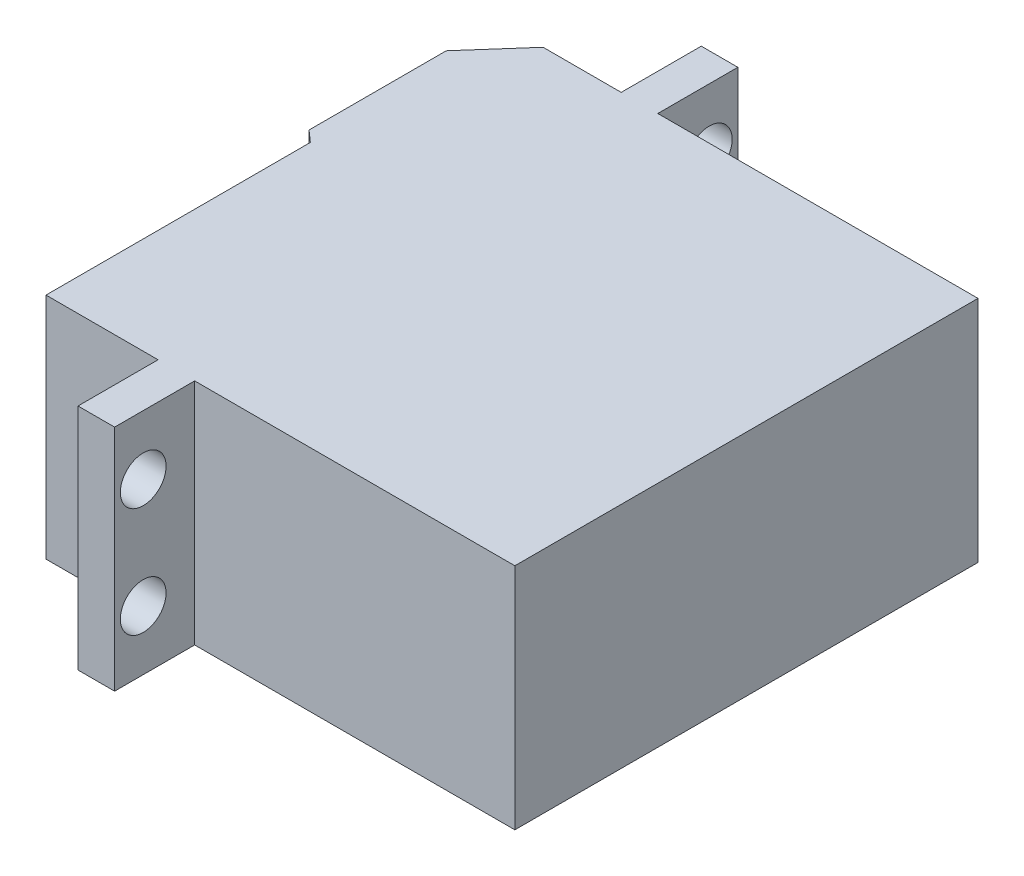
ISO-10303-21;
HEADER;
FILE_DESCRIPTION(('STEP AP214'),'2;1');
FILE_NAME('part.step','',(''),(''),'','','');
FILE_SCHEMA(('AUTOMOTIVE_DESIGN { 1 0 10303 214 1 1 1 1 }'));
ENDSEC;
DATA;
#1=APPLICATION_CONTEXT('core data for automotive mechanical design processes');
#2=APPLICATION_PROTOCOL_DEFINITION('international standard','automotive_design',2000,#1);
#3=PRODUCT_CONTEXT('',#1,'mechanical');
#4=PRODUCT('Part','Part','',(#3));
#5=PRODUCT_RELATED_PRODUCT_CATEGORY('part','',(#4));
#6=PRODUCT_DEFINITION_FORMATION('','',#4);
#7=PRODUCT_DEFINITION_CONTEXT('part definition',#1,'design');
#8=PRODUCT_DEFINITION('design','',#6,#7);
#9=PRODUCT_DEFINITION_SHAPE('','',#8);
#10=(LENGTH_UNIT() NAMED_UNIT(*) SI_UNIT(.MILLI.,.METRE.));
#11=(NAMED_UNIT(*) PLANE_ANGLE_UNIT() SI_UNIT($,.RADIAN.));
#12=(NAMED_UNIT(*) SI_UNIT($,.STERADIAN.) SOLID_ANGLE_UNIT());
#13=UNCERTAINTY_MEASURE_WITH_UNIT(LENGTH_MEASURE(1.E-05),#10,'distance_accuracy_value','');
#14=(GEOMETRIC_REPRESENTATION_CONTEXT(3) GLOBAL_UNCERTAINTY_ASSIGNED_CONTEXT((#13)) GLOBAL_UNIT_ASSIGNED_CONTEXT((#10,
#11,#12)) REPRESENTATION_CONTEXT('',''));
#15=CARTESIAN_POINT('',(0.,0.,0.));
#16=DIRECTION('',(0.,0.,1.));
#17=DIRECTION('',(1.,0.,0.));
#18=AXIS2_PLACEMENT_3D('',#15,#16,#17);
#19=CARTESIAN_POINT('',(-42.,20.,-36.));
#20=DIRECTION('',(1.,0.,0.));
#21=DIRECTION('',(0.,0.,-1.));
#22=AXIS2_PLACEMENT_3D('',#19,#20,#21);
#23=PLANE('',#22);
#24=DIRECTION('',(0.,0.,1.));
#25=VECTOR('',#24,1.);
#26=CARTESIAN_POINT('',(-42.,0.,-36.));
#27=LINE('',#26,#25);
#28=CARTESIAN_POINT('',(-42.,0.,-36.));
#29=VERTEX_POINT('',#28);
#30=CARTESIAN_POINT('',(-42.,0.,-24.));
#31=VERTEX_POINT('',#30);
#32=EDGE_CURVE('E287',#29,#31,#27,.T.);
#33=ORIENTED_EDGE('',*,*,#32,.T.);
#34=DIRECTION('',(0.,-1.,0.));
#35=VECTOR('',#34,1.);
#36=CARTESIAN_POINT('',(-42.,20.,-24.));
#37=LINE('',#36,#35);
#38=CARTESIAN_POINT('',(-42.,20.,-24.));
#39=VERTEX_POINT('',#38);
#40=EDGE_CURVE('E330',#39,#31,#37,.T.);
#41=ORIENTED_EDGE('',*,*,#40,.F.);
#42=DIRECTION('',(0.,0.,1.));
#43=VECTOR('',#42,1.);
#44=CARTESIAN_POINT('',(-42.,20.,-36.));
#45=LINE('',#44,#43);
#46=CARTESIAN_POINT('',(-42.,20.,-36.));
#47=VERTEX_POINT('',#46);
#48=EDGE_CURVE('E245',#47,#39,#45,.T.);
#49=ORIENTED_EDGE('',*,*,#48,.F.);
#50=DIRECTION('',(0.,-1.,0.));
#51=VECTOR('',#50,1.);
#52=CARTESIAN_POINT('',(-42.,20.,-36.));
#53=LINE('',#52,#51);
#54=EDGE_CURVE('E334',#47,#29,#53,.T.);
#55=ORIENTED_EDGE('',*,*,#54,.T.);
#56=EDGE_LOOP('',(#33,#41,#49,#55));
#57=FACE_BOUND('',#56,.T.);
#58=DIRECTION('',(0.,-0.866025403784439,-0.499999999999999));
#59=VECTOR('',#58,1.);
#60=CARTESIAN_POINT('',(-42.,13.,-31.7320508075689));
#61=LINE('',#60,#59);
#62=CARTESIAN_POINT('',(-42.,13.,-31.7320508075689));
#63=VERTEX_POINT('',#62);
#64=CARTESIAN_POINT('',(-42.,10.,-33.4641016151377));
#65=VERTEX_POINT('',#64);
#66=EDGE_CURVE('E57',#63,#65,#61,.T.);
#67=ORIENTED_EDGE('',*,*,#66,.F.);
#68=DIRECTION('',(0.,0.,-1.));
#69=VECTOR('',#68,1.);
#70=CARTESIAN_POINT('',(-42.,13.,-28.2679491924311));
#71=LINE('',#70,#69);
#72=CARTESIAN_POINT('',(-42.,13.,-28.2679491924311));
#73=VERTEX_POINT('',#72);
#74=EDGE_CURVE('E61',#73,#63,#71,.T.);
#75=ORIENTED_EDGE('',*,*,#74,.F.);
#76=DIRECTION('',(0.,0.866025403784439,-0.5));
#77=VECTOR('',#76,1.);
#78=CARTESIAN_POINT('',(-42.,10.,-26.5358983848622));
#79=LINE('',#78,#77);
#80=CARTESIAN_POINT('',(-42.,10.,-26.5358983848622));
#81=VERTEX_POINT('',#80);
#82=EDGE_CURVE('E414',#81,#73,#79,.T.);
#83=ORIENTED_EDGE('',*,*,#82,.F.);
#84=DIRECTION('',(0.,0.866025403784438,0.5));
#85=VECTOR('',#84,1.);
#86=CARTESIAN_POINT('',(-42.,7.,-28.2679491924311));
#87=LINE('',#86,#85);
#88=CARTESIAN_POINT('',(-42.,7.,-28.2679491924311));
#89=VERTEX_POINT('',#88);
#90=EDGE_CURVE('E410',#89,#81,#87,.T.);
#91=ORIENTED_EDGE('',*,*,#90,.F.);
#92=DIRECTION('',(0.,0.,1.));
#93=VECTOR('',#92,1.);
#94=CARTESIAN_POINT('',(-42.,7.,-31.7320508075689));
#95=LINE('',#94,#93);
#96=CARTESIAN_POINT('',(-42.,7.,-31.7320508075689));
#97=VERTEX_POINT('',#96);
#98=EDGE_CURVE('E406',#97,#89,#95,.T.);
#99=ORIENTED_EDGE('',*,*,#98,.F.);
#100=DIRECTION('',(0.,-0.866025403784439,0.5));
#101=VECTOR('',#100,1.);
#102=CARTESIAN_POINT('',(-42.,10.,-33.4641016151377));
#103=LINE('',#102,#101);
#104=EDGE_CURVE('E403',#65,#97,#103,.T.);
#105=ORIENTED_EDGE('',*,*,#104,.F.);
#106=EDGE_LOOP('',(#67,#75,#83,#91,#99,#105));
#107=FACE_BOUND('',#106,.T.);
#108=ADVANCED_FACE('F39',(#57,#107),#23,.F.);
#109=CARTESIAN_POINT('',(-28.,20.,0.));
#110=DIRECTION('',(0.,0.,-1.));
#111=DIRECTION('',(-1.,0.,0.));
#112=AXIS2_PLACEMENT_3D('',#109,#110,#111);
#113=PLANE('',#112);
#114=DIRECTION('',(1.,0.,0.));
#115=VECTOR('',#114,1.);
#116=CARTESIAN_POINT('',(-28.,0.,0.));
#117=LINE('',#116,#115);
#118=CARTESIAN_POINT('',(-28.,0.,0.));
#119=VERTEX_POINT('',#118);
#120=CARTESIAN_POINT('',(0.,0.,0.));
#121=VERTEX_POINT('',#120);
#122=EDGE_CURVE('E208',#119,#121,#117,.T.);
#123=ORIENTED_EDGE('',*,*,#122,.T.);
#124=DIRECTION('',(0.,-1.,0.));
#125=VECTOR('',#124,1.);
#126=CARTESIAN_POINT('',(0.,20.,0.));
#127=LINE('',#126,#125);
#128=CARTESIAN_POINT('',(0.,20.,0.));
#129=VERTEX_POINT('',#128);
#130=EDGE_CURVE('E11',#129,#121,#127,.T.);
#131=ORIENTED_EDGE('',*,*,#130,.F.);
#132=DIRECTION('',(1.,0.,0.));
#133=VECTOR('',#132,1.);
#134=CARTESIAN_POINT('',(-28.,20.,0.));
#135=LINE('',#134,#133);
#136=CARTESIAN_POINT('',(-28.,20.,0.));
#137=VERTEX_POINT('',#136);
#138=EDGE_CURVE('E219',#137,#129,#135,.T.);
#139=ORIENTED_EDGE('',*,*,#138,.F.);
#140=DIRECTION('',(0.,-1.,0.));
#141=VECTOR('',#140,1.);
#142=CARTESIAN_POINT('',(-28.,20.,0.));
#143=LINE('',#142,#141);
#144=EDGE_CURVE('E265',#137,#119,#143,.T.);
#145=ORIENTED_EDGE('',*,*,#144,.T.);
#146=EDGE_LOOP('',(#123,#131,#139,#145));
#147=FACE_BOUND('',#146,.T.);
#148=ADVANCED_FACE('F41',(#147),#113,.F.);
#149=CARTESIAN_POINT('',(0.,20.,0.));
#150=DIRECTION('',(-1.,0.,0.));
#151=DIRECTION('',(0.,0.,1.));
#152=AXIS2_PLACEMENT_3D('',#149,#150,#151);
#153=PLANE('',#152);
#154=DIRECTION('',(0.,0.,-1.));
#155=VECTOR('',#154,1.);
#156=CARTESIAN_POINT('',(0.,0.,0.));
#157=LINE('',#156,#155);
#158=CARTESIAN_POINT('',(0.,0.,-40.5));
#159=VERTEX_POINT('',#158);
#160=EDGE_CURVE('E213',#121,#159,#157,.T.);
#161=ORIENTED_EDGE('',*,*,#160,.T.);
#162=DIRECTION('',(0.,-1.,0.));
#163=VECTOR('',#162,1.);
#164=CARTESIAN_POINT('',(0.,20.,-40.5));
#165=LINE('',#164,#163);
#166=CARTESIAN_POINT('',(0.,20.,-40.5));
#167=VERTEX_POINT('',#166);
#168=EDGE_CURVE('E49',#167,#159,#165,.T.);
#169=ORIENTED_EDGE('',*,*,#168,.F.);
#170=DIRECTION('',(0.,0.,-1.));
#171=VECTOR('',#170,1.);
#172=CARTESIAN_POINT('',(0.,20.,0.));
#173=LINE('',#172,#171);
#174=EDGE_CURVE('E223',#129,#167,#173,.T.);
#175=ORIENTED_EDGE('',*,*,#174,.F.);
#176=ORIENTED_EDGE('',*,*,#130,.T.);
#177=EDGE_LOOP('',(#161,#169,#175,#176));
#178=FACE_BOUND('',#177,.T.);
#179=ADVANCED_FACE('F459',(#178),#153,.F.);
#180=CARTESIAN_POINT('',(0.,20.,-40.5));
#181=DIRECTION('',(0.,0.,1.));
#182=DIRECTION('',(1.,0.,0.));
#183=AXIS2_PLACEMENT_3D('',#180,#181,#182);
#184=PLANE('',#183);
#185=DIRECTION('',(-1.,0.,0.));
#186=VECTOR('',#185,1.);
#187=CARTESIAN_POINT('',(0.,0.,-40.5));
#188=LINE('',#187,#186);
#189=CARTESIAN_POINT('',(-28.,0.,-40.5));
#190=VERTEX_POINT('',#189);
#191=EDGE_CURVE('E269',#159,#190,#188,.T.);
#192=ORIENTED_EDGE('',*,*,#191,.T.);
#193=DIRECTION('',(0.,-1.,0.));
#194=VECTOR('',#193,1.);
#195=CARTESIAN_POINT('',(-28.,20.,-40.5));
#196=LINE('',#195,#194);
#197=CARTESIAN_POINT('',(-28.,20.,-40.5));
#198=VERTEX_POINT('',#197);
#199=EDGE_CURVE('E354',#198,#190,#196,.T.);
#200=ORIENTED_EDGE('',*,*,#199,.F.);
#201=DIRECTION('',(-1.,0.,0.));
#202=VECTOR('',#201,1.);
#203=CARTESIAN_POINT('',(0.,20.,-40.5));
#204=LINE('',#203,#202);
#205=EDGE_CURVE('E227',#167,#198,#204,.T.);
#206=ORIENTED_EDGE('',*,*,#205,.F.);
#207=ORIENTED_EDGE('',*,*,#168,.T.);
#208=EDGE_LOOP('',(#192,#200,#206,#207));
#209=FACE_BOUND('',#208,.T.);
#210=ADVANCED_FACE('F484',(#209),#184,.F.);
#211=CARTESIAN_POINT('',(-28.,20.,-40.5));
#212=DIRECTION('',(-1.,0.,0.));
#213=DIRECTION('',(0.,0.,1.));
#214=AXIS2_PLACEMENT_3D('',#211,#212,#213);
#215=PLANE('',#214);
#216=CARTESIAN_POINT('',(-28.,14.8,-45.));
#217=DIRECTION('',(-1.,0.,0.));
#218=DIRECTION('',(0.,0.,1.));
#219=AXIS2_PLACEMENT_3D('',#216,#217,#218);
#220=CIRCLE('',#219,2.);
#221=CARTESIAN_POINT('',(-28.,14.8,-43.));
#222=VERTEX_POINT('',#221);
#223=EDGE_CURVE('E386',#222,#222,#220,.T.);
#224=ORIENTED_EDGE('',*,*,#223,.T.);
#225=EDGE_LOOP('',(#224));
#226=FACE_BOUND('',#225,.T.);
#227=CARTESIAN_POINT('',(-28.,5.2,-45.));
#228=DIRECTION('',(-1.,0.,0.));
#229=DIRECTION('',(0.,0.,1.));
#230=AXIS2_PLACEMENT_3D('',#227,#228,#229);
#231=CIRCLE('',#230,2.);
#232=CARTESIAN_POINT('',(-28.,5.2,-43.));
#233=VERTEX_POINT('',#232);
#234=EDGE_CURVE('E369',#233,#233,#231,.T.);
#235=ORIENTED_EDGE('',*,*,#234,.T.);
#236=EDGE_LOOP('',(#235));
#237=FACE_BOUND('',#236,.T.);
#238=DIRECTION('',(0.,0.,-1.));
#239=VECTOR('',#238,1.);
#240=CARTESIAN_POINT('',(-28.,0.,-40.5));
#241=LINE('',#240,#239);
#242=CARTESIAN_POINT('',(-28.,0.,-47.5));
#243=VERTEX_POINT('',#242);
#244=EDGE_CURVE('E272',#190,#243,#241,.T.);
#245=ORIENTED_EDGE('',*,*,#244,.T.);
#246=DIRECTION('',(0.,-1.,0.));
#247=VECTOR('',#246,1.);
#248=CARTESIAN_POINT('',(-28.,20.,-47.5));
#249=LINE('',#248,#247);
#250=CARTESIAN_POINT('',(-28.,20.,-47.5));
#251=VERTEX_POINT('',#250);
#252=EDGE_CURVE('E350',#251,#243,#249,.T.);
#253=ORIENTED_EDGE('',*,*,#252,.F.);
#254=DIRECTION('',(0.,0.,-1.));
#255=VECTOR('',#254,1.);
#256=CARTESIAN_POINT('',(-28.,20.,-40.5));
#257=LINE('',#256,#255);
#258=EDGE_CURVE('E230',#198,#251,#257,.T.);
#259=ORIENTED_EDGE('',*,*,#258,.F.);
#260=ORIENTED_EDGE('',*,*,#199,.T.);
#261=EDGE_LOOP('',(#245,#253,#259,#260));
#262=FACE_BOUND('',#261,.T.);
#263=ADVANCED_FACE('F480',(#226,#237,#262),#215,.F.);
#264=CARTESIAN_POINT('',(-28.,20.,-47.5));
#265=DIRECTION('',(0.,0.,1.));
#266=DIRECTION('',(1.,0.,0.));
#267=AXIS2_PLACEMENT_3D('',#264,#265,#266);
#268=PLANE('',#267);
#269=DIRECTION('',(-1.,0.,0.));
#270=VECTOR('',#269,1.);
#271=CARTESIAN_POINT('',(-28.,0.,-47.5));
#272=LINE('',#271,#270);
#273=CARTESIAN_POINT('',(-31.2,0.,-47.5));
#274=VERTEX_POINT('',#273);
#275=EDGE_CURVE('E275',#243,#274,#272,.T.);
#276=ORIENTED_EDGE('',*,*,#275,.T.);
#277=DIRECTION('',(0.,-1.,0.));
#278=VECTOR('',#277,1.);
#279=CARTESIAN_POINT('',(-31.2,20.,-47.5));
#280=LINE('',#279,#278);
#281=CARTESIAN_POINT('',(-31.2,20.,-47.5));
#282=VERTEX_POINT('',#281);
#283=EDGE_CURVE('E346',#282,#274,#280,.T.);
#284=ORIENTED_EDGE('',*,*,#283,.F.);
#285=DIRECTION('',(-1.,0.,0.));
#286=VECTOR('',#285,1.);
#287=CARTESIAN_POINT('',(-28.,20.,-47.5));
#288=LINE('',#287,#286);
#289=EDGE_CURVE('E233',#251,#282,#288,.T.);
#290=ORIENTED_EDGE('',*,*,#289,.F.);
#291=ORIENTED_EDGE('',*,*,#252,.T.);
#292=EDGE_LOOP('',(#276,#284,#290,#291));
#293=FACE_BOUND('',#292,.T.);
#294=ADVANCED_FACE('F476',(#293),#268,.F.);
#295=CARTESIAN_POINT('',(-31.2,20.,-47.5));
#296=DIRECTION('',(1.,0.,0.));
#297=DIRECTION('',(0.,0.,-1.));
#298=AXIS2_PLACEMENT_3D('',#295,#296,#297);
#299=PLANE('',#298);
#300=CARTESIAN_POINT('',(-31.2,14.8,-45.));
#301=DIRECTION('',(-1.,0.,0.));
#302=DIRECTION('',(0.,0.,-1.));
#303=AXIS2_PLACEMENT_3D('',#300,#301,#302);
#304=CIRCLE('',#303,2.);
#305=CARTESIAN_POINT('',(-31.2,14.8,-47.));
#306=VERTEX_POINT('',#305);
#307=EDGE_CURVE('E371',#306,#306,#304,.T.);
#308=ORIENTED_EDGE('',*,*,#307,.F.);
#309=EDGE_LOOP('',(#308));
#310=FACE_BOUND('',#309,.T.);
#311=CARTESIAN_POINT('',(-31.2,5.2,-45.));
#312=DIRECTION('',(-1.,0.,0.));
#313=DIRECTION('',(0.,0.,1.));
#314=AXIS2_PLACEMENT_3D('',#311,#312,#313);
#315=CIRCLE('',#314,2.);
#316=CARTESIAN_POINT('',(-31.2,5.2,-43.));
#317=VERTEX_POINT('',#316);
#318=EDGE_CURVE('E363',#317,#317,#315,.T.);
#319=ORIENTED_EDGE('',*,*,#318,.F.);
#320=EDGE_LOOP('',(#319));
#321=FACE_BOUND('',#320,.T.);
#322=DIRECTION('',(0.,0.,1.));
#323=VECTOR('',#322,1.);
#324=CARTESIAN_POINT('',(-31.2,0.,-47.5));
#325=LINE('',#324,#323);
#326=CARTESIAN_POINT('',(-31.2,0.,-40.5));
#327=VERTEX_POINT('',#326);
#328=EDGE_CURVE('E278',#274,#327,#325,.T.);
#329=ORIENTED_EDGE('',*,*,#328,.T.);
#330=DIRECTION('',(0.,-1.,0.));
#331=VECTOR('',#330,1.);
#332=CARTESIAN_POINT('',(-31.2,20.,-40.5));
#333=LINE('',#332,#331);
#334=CARTESIAN_POINT('',(-31.2,20.,-40.5));
#335=VERTEX_POINT('',#334);
#336=EDGE_CURVE('E342',#335,#327,#333,.T.);
#337=ORIENTED_EDGE('',*,*,#336,.F.);
#338=DIRECTION('',(0.,0.,1.));
#339=VECTOR('',#338,1.);
#340=CARTESIAN_POINT('',(-31.2,20.,-47.5));
#341=LINE('',#340,#339);
#342=EDGE_CURVE('E236',#282,#335,#341,.T.);
#343=ORIENTED_EDGE('',*,*,#342,.F.);
#344=ORIENTED_EDGE('',*,*,#283,.T.);
#345=EDGE_LOOP('',(#329,#337,#343,#344));
#346=FACE_BOUND('',#345,.T.);
#347=ADVANCED_FACE('F472',(#310,#321,#346),#299,.F.);
#348=CARTESIAN_POINT('',(-31.2,20.,-40.5));
#349=DIRECTION('',(0.,0.,1.));
#350=DIRECTION('',(1.,0.,0.));
#351=AXIS2_PLACEMENT_3D('',#348,#349,#350);
#352=PLANE('',#351);
#353=DIRECTION('',(-1.,0.,0.));
#354=VECTOR('',#353,1.);
#355=CARTESIAN_POINT('',(-31.2,0.,-40.5));
#356=LINE('',#355,#354);
#357=CARTESIAN_POINT('',(-38.0313730334031,0.,-40.5));
#358=VERTEX_POINT('',#357);
#359=EDGE_CURVE('E281',#327,#358,#356,.T.);
#360=ORIENTED_EDGE('',*,*,#359,.T.);
#361=DIRECTION('',(0.,-1.,0.));
#362=VECTOR('',#361,1.);
#363=CARTESIAN_POINT('',(-38.0313730334031,20.,-40.5));
#364=LINE('',#363,#362);
#365=CARTESIAN_POINT('',(-38.0313730334031,20.,-40.5));
#366=VERTEX_POINT('',#365);
#367=EDGE_CURVE('E338',#366,#358,#364,.T.);
#368=ORIENTED_EDGE('',*,*,#367,.F.);
#369=DIRECTION('',(-1.,0.,0.));
#370=VECTOR('',#369,1.);
#371=CARTESIAN_POINT('',(-31.2,20.,-40.5));
#372=LINE('',#371,#370);
#373=EDGE_CURVE('E239',#335,#366,#372,.T.);
#374=ORIENTED_EDGE('',*,*,#373,.F.);
#375=ORIENTED_EDGE('',*,*,#336,.T.);
#376=EDGE_LOOP('',(#360,#368,#374,#375));
#377=FACE_BOUND('',#376,.T.);
#378=ADVANCED_FACE('F468',(#377),#352,.F.);
#379=CARTESIAN_POINT('',(-38.0313730334031,20.,-40.5));
#380=DIRECTION('',(0.750000000000001,0.,0.661437827766147));
#381=DIRECTION('',(0.661437827766147,0.,-0.750000000000001));
#382=AXIS2_PLACEMENT_3D('',#379,#380,#381);
#383=PLANE('',#382);
#384=DIRECTION('',(-0.661437827766147,0.,0.750000000000001));
#385=VECTOR('',#384,1.);
#386=CARTESIAN_POINT('',(-38.0313730334031,0.,-40.5));
#387=LINE('',#386,#385);
#388=EDGE_CURVE('E284',#358,#29,#387,.T.);
#389=ORIENTED_EDGE('',*,*,#388,.T.);
#390=ORIENTED_EDGE('',*,*,#54,.F.);
#391=DIRECTION('',(-0.661437827766147,0.,0.750000000000001));
#392=VECTOR('',#391,1.);
#393=CARTESIAN_POINT('',(-38.0313730334031,20.,-40.5));
#394=LINE('',#393,#392);
#395=EDGE_CURVE('E242',#366,#47,#394,.T.);
#396=ORIENTED_EDGE('',*,*,#395,.F.);
#397=ORIENTED_EDGE('',*,*,#367,.T.);
#398=EDGE_LOOP('',(#389,#390,#396,#397));
#399=FACE_BOUND('',#398,.T.);
#400=ADVANCED_FACE('F465',(#399),#383,.F.);
#401=CARTESIAN_POINT('',(-42.,20.,-24.));
#402=DIRECTION('',(0.66143782776615,0.,-0.749999999999998));
#403=DIRECTION('',(-0.749999999999998,0.,-0.66143782776615));
#404=AXIS2_PLACEMENT_3D('',#401,#402,#403);
#405=PLANE('',#404);
#406=DIRECTION('',(0.749999999999998,0.,0.66143782776615));
#407=VECTOR('',#406,1.);
#408=CARTESIAN_POINT('',(-42.,0.,-24.));
#409=LINE('',#408,#407);
#410=CARTESIAN_POINT('',(-41.,0.,-23.1180828963118));
#411=VERTEX_POINT('',#410);
#412=EDGE_CURVE('E290',#31,#411,#409,.T.);
#413=ORIENTED_EDGE('',*,*,#412,.T.);
#414=DIRECTION('',(0.,-1.,0.));
#415=VECTOR('',#414,1.);
#416=CARTESIAN_POINT('',(-41.,20.,-23.1180828963118));
#417=LINE('',#416,#415);
#418=CARTESIAN_POINT('',(-41.,20.,-23.1180828963118));
#419=VERTEX_POINT('',#418);
#420=EDGE_CURVE('E326',#419,#411,#417,.T.);
#421=ORIENTED_EDGE('',*,*,#420,.F.);
#422=DIRECTION('',(0.749999999999998,0.,0.66143782776615));
#423=VECTOR('',#422,1.);
#424=CARTESIAN_POINT('',(-42.,20.,-24.));
#425=LINE('',#424,#423);
#426=EDGE_CURVE('E248',#39,#419,#425,.T.);
#427=ORIENTED_EDGE('',*,*,#426,.F.);
#428=ORIENTED_EDGE('',*,*,#40,.T.);
#429=EDGE_LOOP('',(#413,#421,#427,#428));
#430=FACE_BOUND('',#429,.T.);
#431=ADVANCED_FACE('F463',(#430),#405,.F.);
#432=CARTESIAN_POINT('',(-41.,20.,-23.1180828963118));
#433=DIRECTION('',(1.,0.,0.));
#434=DIRECTION('',(0.,0.,-1.));
#435=AXIS2_PLACEMENT_3D('',#432,#433,#434);
#436=PLANE('',#435);
#437=DIRECTION('',(0.,0.,1.));
#438=VECTOR('',#437,1.);
#439=CARTESIAN_POINT('',(-41.,0.,-23.1180828963118));
#440=LINE('',#439,#438);
#441=CARTESIAN_POINT('',(-41.,0.,0.));
#442=VERTEX_POINT('',#441);
#443=EDGE_CURVE('E293',#411,#442,#440,.T.);
#444=ORIENTED_EDGE('',*,*,#443,.T.);
#445=DIRECTION('',(0.,-1.,0.));
#446=VECTOR('',#445,1.);
#447=CARTESIAN_POINT('',(-41.,20.,0.));
#448=LINE('',#447,#446);
#449=CARTESIAN_POINT('',(-41.,20.,0.));
#450=VERTEX_POINT('',#449);
#451=EDGE_CURVE('E322',#450,#442,#448,.T.);
#452=ORIENTED_EDGE('',*,*,#451,.F.);
#453=DIRECTION('',(0.,0.,1.));
#454=VECTOR('',#453,1.);
#455=CARTESIAN_POINT('',(-41.,20.,-23.1180828963118));
#456=LINE('',#455,#454);
#457=EDGE_CURVE('E251',#419,#450,#456,.T.);
#458=ORIENTED_EDGE('',*,*,#457,.F.);
#459=ORIENTED_EDGE('',*,*,#420,.T.);
#460=EDGE_LOOP('',(#444,#452,#458,#459));
#461=FACE_BOUND('',#460,.T.);
#462=ADVANCED_FACE('F538',(#461),#436,.F.);
#463=CARTESIAN_POINT('',(-41.,20.,0.));
#464=DIRECTION('',(0.,0.,-1.));
#465=DIRECTION('',(-1.,0.,0.));
#466=AXIS2_PLACEMENT_3D('',#463,#464,#465);
#467=PLANE('',#466);
#468=DIRECTION('',(1.,0.,0.));
#469=VECTOR('',#468,1.);
#470=CARTESIAN_POINT('',(-41.,0.,0.));
#471=LINE('',#470,#469);
#472=CARTESIAN_POINT('',(-31.2,0.,0.));
#473=VERTEX_POINT('',#472);
#474=EDGE_CURVE('E296',#442,#473,#471,.T.);
#475=ORIENTED_EDGE('',*,*,#474,.T.);
#476=DIRECTION('',(0.,-1.,0.));
#477=VECTOR('',#476,1.);
#478=CARTESIAN_POINT('',(-31.2,20.,0.));
#479=LINE('',#478,#477);
#480=CARTESIAN_POINT('',(-31.2,20.,0.));
#481=VERTEX_POINT('',#480);
#482=EDGE_CURVE('E318',#481,#473,#479,.T.);
#483=ORIENTED_EDGE('',*,*,#482,.F.);
#484=DIRECTION('',(1.,0.,0.));
#485=VECTOR('',#484,1.);
#486=CARTESIAN_POINT('',(-41.,20.,0.));
#487=LINE('',#486,#485);
#488=EDGE_CURVE('E254',#450,#481,#487,.T.);
#489=ORIENTED_EDGE('',*,*,#488,.F.);
#490=ORIENTED_EDGE('',*,*,#451,.T.);
#491=EDGE_LOOP('',(#475,#483,#489,#490));
#492=FACE_BOUND('',#491,.T.);
#493=ADVANCED_FACE('F533',(#492),#467,.F.);
#494=CARTESIAN_POINT('',(-31.2,20.,0.));
#495=DIRECTION('',(1.,0.,0.));
#496=DIRECTION('',(0.,0.,-1.));
#497=AXIS2_PLACEMENT_3D('',#494,#495,#496);
#498=PLANE('',#497);
#499=CARTESIAN_POINT('',(-31.2,5.2,4.5));
#500=DIRECTION('',(-1.,0.,0.));
#501=DIRECTION('',(0.,0.,-1.));
#502=AXIS2_PLACEMENT_3D('',#499,#500,#501);
#503=CIRCLE('',#502,2.);
#504=CARTESIAN_POINT('',(-31.2,5.2,2.49999999999999));
#505=VERTEX_POINT('',#504);
#506=EDGE_CURVE('E381',#505,#505,#503,.T.);
#507=ORIENTED_EDGE('',*,*,#506,.F.);
#508=EDGE_LOOP('',(#507));
#509=FACE_BOUND('',#508,.T.);
#510=CARTESIAN_POINT('',(-31.2,14.8,4.5));
#511=DIRECTION('',(-1.,0.,0.));
#512=DIRECTION('',(0.,0.,1.));
#513=AXIS2_PLACEMENT_3D('',#510,#511,#512);
#514=CIRCLE('',#513,2.);
#515=CARTESIAN_POINT('',(-31.2,14.8,6.5));
#516=VERTEX_POINT('',#515);
#517=EDGE_CURVE('E377',#516,#516,#514,.T.);
#518=ORIENTED_EDGE('',*,*,#517,.F.);
#519=EDGE_LOOP('',(#518));
#520=FACE_BOUND('',#519,.T.);
#521=DIRECTION('',(0.,0.,1.));
#522=VECTOR('',#521,1.);
#523=CARTESIAN_POINT('',(-31.2,0.,0.));
#524=LINE('',#523,#522);
#525=CARTESIAN_POINT('',(-31.2,0.,7.));
#526=VERTEX_POINT('',#525);
#527=EDGE_CURVE('E299',#473,#526,#524,.T.);
#528=ORIENTED_EDGE('',*,*,#527,.T.);
#529=DIRECTION('',(0.,-1.,0.));
#530=VECTOR('',#529,1.);
#531=CARTESIAN_POINT('',(-31.2,20.,7.));
#532=LINE('',#531,#530);
#533=CARTESIAN_POINT('',(-31.2,20.,7.));
#534=VERTEX_POINT('',#533);
#535=EDGE_CURVE('E314',#534,#526,#532,.T.);
#536=ORIENTED_EDGE('',*,*,#535,.F.);
#537=DIRECTION('',(0.,0.,1.));
#538=VECTOR('',#537,1.);
#539=CARTESIAN_POINT('',(-31.2,20.,0.));
#540=LINE('',#539,#538);
#541=EDGE_CURVE('E257',#481,#534,#540,.T.);
#542=ORIENTED_EDGE('',*,*,#541,.F.);
#543=ORIENTED_EDGE('',*,*,#482,.T.);
#544=EDGE_LOOP('',(#528,#536,#542,#543));
#545=FACE_BOUND('',#544,.T.);
#546=ADVANCED_FACE('F527',(#509,#520,#545),#498,.F.);
#547=CARTESIAN_POINT('',(-31.2,20.,7.));
#548=DIRECTION('',(0.,0.,-1.));
#549=DIRECTION('',(-1.,0.,0.));
#550=AXIS2_PLACEMENT_3D('',#547,#548,#549);
#551=PLANE('',#550);
#552=DIRECTION('',(1.,0.,0.));
#553=VECTOR('',#552,1.);
#554=CARTESIAN_POINT('',(-31.2,0.,7.));
#555=LINE('',#554,#553);
#556=CARTESIAN_POINT('',(-28.,0.,7.));
#557=VERTEX_POINT('',#556);
#558=EDGE_CURVE('E302',#526,#557,#555,.T.);
#559=ORIENTED_EDGE('',*,*,#558,.T.);
#560=DIRECTION('',(0.,-1.,0.));
#561=VECTOR('',#560,1.);
#562=CARTESIAN_POINT('',(-28.,20.,7.));
#563=LINE('',#562,#561);
#564=CARTESIAN_POINT('',(-28.,20.,7.));
#565=VERTEX_POINT('',#564);
#566=EDGE_CURVE('E310',#565,#557,#563,.T.);
#567=ORIENTED_EDGE('',*,*,#566,.F.);
#568=DIRECTION('',(1.,0.,0.));
#569=VECTOR('',#568,1.);
#570=CARTESIAN_POINT('',(-31.2,20.,7.));
#571=LINE('',#570,#569);
#572=EDGE_CURVE('E260',#534,#565,#571,.T.);
#573=ORIENTED_EDGE('',*,*,#572,.F.);
#574=ORIENTED_EDGE('',*,*,#535,.T.);
#575=EDGE_LOOP('',(#559,#567,#573,#574));
#576=FACE_BOUND('',#575,.T.);
#577=ADVANCED_FACE('F523',(#576),#551,.F.);
#578=CARTESIAN_POINT('',(-28.,20.,7.));
#579=DIRECTION('',(-1.,0.,0.));
#580=DIRECTION('',(0.,0.,1.));
#581=AXIS2_PLACEMENT_3D('',#578,#579,#580);
#582=PLANE('',#581);
#583=CARTESIAN_POINT('',(-28.,5.2,4.5));
#584=DIRECTION('',(-1.,0.,0.));
#585=DIRECTION('',(0.,0.,1.));
#586=AXIS2_PLACEMENT_3D('',#583,#584,#585);
#587=CIRCLE('',#586,2.);
#588=CARTESIAN_POINT('',(-28.,5.2,6.5));
#589=VERTEX_POINT('',#588);
#590=EDGE_CURVE('E43',#589,#589,#587,.T.);
#591=ORIENTED_EDGE('',*,*,#590,.T.);
#592=EDGE_LOOP('',(#591));
#593=FACE_BOUND('',#592,.T.);
#594=CARTESIAN_POINT('',(-28.,14.8,4.5));
#595=DIRECTION('',(-1.,0.,0.));
#596=DIRECTION('',(0.,0.,1.));
#597=AXIS2_PLACEMENT_3D('',#594,#595,#596);
#598=CIRCLE('',#597,2.);
#599=CARTESIAN_POINT('',(-28.,14.8,6.5));
#600=VERTEX_POINT('',#599);
#601=EDGE_CURVE('E360',#600,#600,#598,.T.);
#602=ORIENTED_EDGE('',*,*,#601,.T.);
#603=EDGE_LOOP('',(#602));
#604=FACE_BOUND('',#603,.T.);
#605=DIRECTION('',(0.,0.,-1.));
#606=VECTOR('',#605,1.);
#607=CARTESIAN_POINT('',(-28.,0.,7.));
#608=LINE('',#607,#606);
#609=EDGE_CURVE('E224',#557,#119,#608,.T.);
#610=ORIENTED_EDGE('',*,*,#609,.T.);
#611=ORIENTED_EDGE('',*,*,#144,.F.);
#612=DIRECTION('',(0.,0.,-1.));
#613=VECTOR('',#612,1.);
#614=CARTESIAN_POINT('',(-28.,20.,7.));
#615=LINE('',#614,#613);
#616=EDGE_CURVE('E263',#565,#137,#615,.T.);
#617=ORIENTED_EDGE('',*,*,#616,.F.);
#618=ORIENTED_EDGE('',*,*,#566,.T.);
#619=EDGE_LOOP('',(#610,#611,#617,#618));
#620=FACE_BOUND('',#619,.T.);
#621=ADVANCED_FACE('F519',(#593,#604,#620),#582,.F.);
#622=CARTESIAN_POINT('',(0.,20.,0.));
#623=DIRECTION('',(0.,1.,0.));
#624=DIRECTION('',(0.,0.,1.));
#625=AXIS2_PLACEMENT_3D('',#622,#623,#624);
#626=PLANE('',#625);
#627=ORIENTED_EDGE('',*,*,#138,.T.);
#628=ORIENTED_EDGE('',*,*,#174,.T.);
#629=ORIENTED_EDGE('',*,*,#205,.T.);
#630=ORIENTED_EDGE('',*,*,#258,.T.);
#631=ORIENTED_EDGE('',*,*,#289,.T.);
#632=ORIENTED_EDGE('',*,*,#342,.T.);
#633=ORIENTED_EDGE('',*,*,#373,.T.);
#634=ORIENTED_EDGE('',*,*,#395,.T.);
#635=ORIENTED_EDGE('',*,*,#48,.T.);
#636=ORIENTED_EDGE('',*,*,#426,.T.);
#637=ORIENTED_EDGE('',*,*,#457,.T.);
#638=ORIENTED_EDGE('',*,*,#488,.T.);
#639=ORIENTED_EDGE('',*,*,#541,.T.);
#640=ORIENTED_EDGE('',*,*,#572,.T.);
#641=ORIENTED_EDGE('',*,*,#616,.T.);
#642=EDGE_LOOP('',(#627,#628,#629,#630,#631,#632,#633,#634,#635,#636,#637,#638,#639,#640,#641));
#643=FACE_BOUND('',#642,.T.);
#644=ADVANCED_FACE('F510',(#643),#626,.T.);
#645=CARTESIAN_POINT('',(0.,0.,0.));
#646=DIRECTION('',(0.,1.,0.));
#647=DIRECTION('',(0.,0.,1.));
#648=AXIS2_PLACEMENT_3D('',#645,#646,#647);
#649=PLANE('',#648);
#650=ORIENTED_EDGE('',*,*,#122,.F.);
#651=ORIENTED_EDGE('',*,*,#609,.F.);
#652=ORIENTED_EDGE('',*,*,#558,.F.);
#653=ORIENTED_EDGE('',*,*,#527,.F.);
#654=ORIENTED_EDGE('',*,*,#474,.F.);
#655=ORIENTED_EDGE('',*,*,#443,.F.);
#656=ORIENTED_EDGE('',*,*,#412,.F.);
#657=ORIENTED_EDGE('',*,*,#32,.F.);
#658=ORIENTED_EDGE('',*,*,#388,.F.);
#659=ORIENTED_EDGE('',*,*,#359,.F.);
#660=ORIENTED_EDGE('',*,*,#328,.F.);
#661=ORIENTED_EDGE('',*,*,#275,.F.);
#662=ORIENTED_EDGE('',*,*,#244,.F.);
#663=ORIENTED_EDGE('',*,*,#191,.F.);
#664=ORIENTED_EDGE('',*,*,#160,.F.);
#665=EDGE_LOOP('',(#650,#651,#652,#653,#654,#655,#656,#657,#658,#659,#660,#661,#662,#663,#664));
#666=FACE_BOUND('',#665,.T.);
#667=ADVANCED_FACE('F500',(#666),#649,.F.);
#668=CARTESIAN_POINT('',(-46.,13.,-31.7320508075689));
#669=DIRECTION('',(0.,-0.499999999999999,0.866025403784439));
#670=DIRECTION('',(0.,-0.866025403784439,-0.499999999999999));
#671=AXIS2_PLACEMENT_3D('',#668,#669,#670);
#672=PLANE('',#671);
#673=ORIENTED_EDGE('',*,*,#66,.T.);
#674=DIRECTION('',(1.,0.,0.));
#675=VECTOR('',#674,1.);
#676=CARTESIAN_POINT('',(-46.,10.,-33.4641016151377));
#677=LINE('',#676,#675);
#678=CARTESIAN_POINT('',(-46.,10.,-33.4641016151377));
#679=VERTEX_POINT('',#678);
#680=EDGE_CURVE('E188',#679,#65,#677,.T.);
#681=ORIENTED_EDGE('',*,*,#680,.F.);
#682=DIRECTION('',(0.,-0.866025403784439,-0.499999999999999));
#683=VECTOR('',#682,1.);
#684=CARTESIAN_POINT('',(-46.,13.,-31.7320508075689));
#685=LINE('',#684,#683);
#686=CARTESIAN_POINT('',(-46.,13.,-31.7320508075689));
#687=VERTEX_POINT('',#686);
#688=EDGE_CURVE('E195',#687,#679,#685,.T.);
#689=ORIENTED_EDGE('',*,*,#688,.F.);
#690=DIRECTION('',(1.,0.,0.));
#691=VECTOR('',#690,1.);
#692=CARTESIAN_POINT('',(-46.,13.,-31.7320508075689));
#693=LINE('',#692,#691);
#694=EDGE_CURVE('E400',#687,#63,#693,.T.);
#695=ORIENTED_EDGE('',*,*,#694,.T.);
#696=EDGE_LOOP('',(#673,#681,#689,#695));
#697=FACE_BOUND('',#696,.T.);
#698=ADVANCED_FACE('F206',(#697),#672,.F.);
#699=CARTESIAN_POINT('',(-46.,10.,-33.4641016151377));
#700=DIRECTION('',(0.,0.5,0.866025403784439));
#701=DIRECTION('',(0.,-0.866025403784439,0.5));
#702=AXIS2_PLACEMENT_3D('',#699,#700,#701);
#703=PLANE('',#702);
#704=ORIENTED_EDGE('',*,*,#104,.T.);
#705=DIRECTION('',(1.,0.,0.));
#706=VECTOR('',#705,1.);
#707=CARTESIAN_POINT('',(-46.,7.,-31.7320508075689));
#708=LINE('',#707,#706);
#709=CARTESIAN_POINT('',(-46.,7.,-31.7320508075689));
#710=VERTEX_POINT('',#709);
#711=EDGE_CURVE('E190',#710,#97,#708,.T.);
#712=ORIENTED_EDGE('',*,*,#711,.F.);
#713=DIRECTION('',(0.,-0.866025403784439,0.5));
#714=VECTOR('',#713,1.);
#715=CARTESIAN_POINT('',(-46.,10.,-33.4641016151377));
#716=LINE('',#715,#714);
#717=EDGE_CURVE('E183',#679,#710,#716,.T.);
#718=ORIENTED_EDGE('',*,*,#717,.F.);
#719=ORIENTED_EDGE('',*,*,#680,.T.);
#720=EDGE_LOOP('',(#704,#712,#718,#719));
#721=FACE_BOUND('',#720,.T.);
#722=ADVANCED_FACE('F186',(#721),#703,.F.);
#723=CARTESIAN_POINT('',(-46.,7.,-31.7320508075689));
#724=DIRECTION('',(0.,1.,0.));
#725=DIRECTION('',(0.,0.,1.));
#726=AXIS2_PLACEMENT_3D('',#723,#724,#725);
#727=PLANE('',#726);
#728=ORIENTED_EDGE('',*,*,#98,.T.);
#729=DIRECTION('',(1.,0.,0.));
#730=VECTOR('',#729,1.);
#731=CARTESIAN_POINT('',(-46.,7.,-28.2679491924311));
#732=LINE('',#731,#730);
#733=CARTESIAN_POINT('',(-46.,7.,-28.2679491924311));
#734=VERTEX_POINT('',#733);
#735=EDGE_CURVE('E215',#734,#89,#732,.T.);
#736=ORIENTED_EDGE('',*,*,#735,.F.);
#737=DIRECTION('',(0.,0.,1.));
#738=VECTOR('',#737,1.);
#739=CARTESIAN_POINT('',(-46.,7.,-31.7320508075689));
#740=LINE('',#739,#738);
#741=EDGE_CURVE('E194',#710,#734,#740,.T.);
#742=ORIENTED_EDGE('',*,*,#741,.F.);
#743=ORIENTED_EDGE('',*,*,#711,.T.);
#744=EDGE_LOOP('',(#728,#736,#742,#743));
#745=FACE_BOUND('',#744,.T.);
#746=ADVANCED_FACE('F436',(#745),#727,.F.);
#747=CARTESIAN_POINT('',(-46.,7.,-28.2679491924311));
#748=DIRECTION('',(0.,0.5,-0.866025403784439));
#749=DIRECTION('',(0.,0.866025403784438,0.5));
#750=AXIS2_PLACEMENT_3D('',#747,#748,#749);
#751=PLANE('',#750);
#752=ORIENTED_EDGE('',*,*,#90,.T.);
#753=DIRECTION('',(1.,0.,0.));
#754=VECTOR('',#753,1.);
#755=CARTESIAN_POINT('',(-46.,10.,-26.5358983848622));
#756=LINE('',#755,#754);
#757=CARTESIAN_POINT('',(-46.,10.,-26.5358983848622));
#758=VERTEX_POINT('',#757);
#759=EDGE_CURVE('E425',#758,#81,#756,.T.);
#760=ORIENTED_EDGE('',*,*,#759,.F.);
#761=DIRECTION('',(0.,0.866025403784438,0.5));
#762=VECTOR('',#761,1.);
#763=CARTESIAN_POINT('',(-46.,7.,-28.2679491924311));
#764=LINE('',#763,#762);
#765=EDGE_CURVE('E392',#734,#758,#764,.T.);
#766=ORIENTED_EDGE('',*,*,#765,.F.);
#767=ORIENTED_EDGE('',*,*,#735,.T.);
#768=EDGE_LOOP('',(#752,#760,#766,#767));
#769=FACE_BOUND('',#768,.T.);
#770=ADVANCED_FACE('F433',(#769),#751,.F.);
#771=CARTESIAN_POINT('',(-46.,10.,-26.5358983848622));
#772=DIRECTION('',(0.,-0.5,-0.866025403784439));
#773=DIRECTION('',(0.,0.866025403784439,-0.5));
#774=AXIS2_PLACEMENT_3D('',#771,#772,#773);
#775=PLANE('',#774);
#776=ORIENTED_EDGE('',*,*,#82,.T.);
#777=DIRECTION('',(1.,0.,0.));
#778=VECTOR('',#777,1.);
#779=CARTESIAN_POINT('',(-46.,13.,-28.2679491924311));
#780=LINE('',#779,#778);
#781=CARTESIAN_POINT('',(-46.,13.,-28.2679491924311));
#782=VERTEX_POINT('',#781);
#783=EDGE_CURVE('E421',#782,#73,#780,.T.);
#784=ORIENTED_EDGE('',*,*,#783,.F.);
#785=DIRECTION('',(0.,0.866025403784439,-0.5));
#786=VECTOR('',#785,1.);
#787=CARTESIAN_POINT('',(-46.,10.,-26.5358983848622));
#788=LINE('',#787,#786);
#789=EDGE_CURVE('E395',#758,#782,#788,.T.);
#790=ORIENTED_EDGE('',*,*,#789,.F.);
#791=ORIENTED_EDGE('',*,*,#759,.T.);
#792=EDGE_LOOP('',(#776,#784,#790,#791));
#793=FACE_BOUND('',#792,.T.);
#794=ADVANCED_FACE('F439',(#793),#775,.F.);
#795=CARTESIAN_POINT('',(-46.,13.,-28.2679491924311));
#796=DIRECTION('',(0.,-1.,0.));
#797=DIRECTION('',(0.,0.,-1.));
#798=AXIS2_PLACEMENT_3D('',#795,#796,#797);
#799=PLANE('',#798);
#800=ORIENTED_EDGE('',*,*,#74,.T.);
#801=ORIENTED_EDGE('',*,*,#694,.F.);
#802=DIRECTION('',(0.,0.,-1.));
#803=VECTOR('',#802,1.);
#804=CARTESIAN_POINT('',(-46.,13.,-28.2679491924311));
#805=LINE('',#804,#803);
#806=EDGE_CURVE('E200',#782,#687,#805,.T.);
#807=ORIENTED_EDGE('',*,*,#806,.F.);
#808=ORIENTED_EDGE('',*,*,#783,.T.);
#809=EDGE_LOOP('',(#800,#801,#807,#808));
#810=FACE_BOUND('',#809,.T.);
#811=ADVANCED_FACE('F442',(#810),#799,.F.);
#812=CARTESIAN_POINT('',(-46.,0.,0.));
#813=DIRECTION('',(-1.,0.,0.));
#814=DIRECTION('',(0.,0.,1.));
#815=AXIS2_PLACEMENT_3D('',#812,#813,#814);
#816=PLANE('',#815);
#817=CARTESIAN_POINT('',(-46.,10.,-30.));
#818=DIRECTION('',(-1.,0.,0.));
#819=DIRECTION('',(0.,0.,1.));
#820=AXIS2_PLACEMENT_3D('',#817,#818,#819);
#821=CIRCLE('',#820,1.5);
#822=CARTESIAN_POINT('',(-46.,10.,-28.5));
#823=VERTEX_POINT('',#822);
#824=EDGE_CURVE('E694',#823,#823,#821,.T.);
#825=ORIENTED_EDGE('',*,*,#824,.F.);
#826=EDGE_LOOP('',(#825));
#827=FACE_BOUND('',#826,.T.);
#828=ORIENTED_EDGE('',*,*,#688,.T.);
#829=ORIENTED_EDGE('',*,*,#717,.T.);
#830=ORIENTED_EDGE('',*,*,#741,.T.);
#831=ORIENTED_EDGE('',*,*,#765,.T.);
#832=ORIENTED_EDGE('',*,*,#789,.T.);
#833=ORIENTED_EDGE('',*,*,#806,.T.);
#834=EDGE_LOOP('',(#828,#829,#830,#831,#832,#833));
#835=FACE_BOUND('',#834,.T.);
#836=ADVANCED_FACE('F198',(#827,#835),#816,.T.);
#837=CARTESIAN_POINT('',(0.,14.8,4.50000000000001));
#838=DIRECTION('',(-1.,0.,0.));
#839=DIRECTION('',(0.,0.,1.));
#840=AXIS2_PLACEMENT_3D('',#837,#838,#839);
#841=CYLINDRICAL_SURFACE('',#840,2.);
#842=ORIENTED_EDGE('',*,*,#517,.T.);
#843=EDGE_LOOP('',(#842));
#844=FACE_BOUND('',#843,.T.);
#845=ORIENTED_EDGE('',*,*,#601,.F.);
#846=EDGE_LOOP('',(#845));
#847=FACE_BOUND('',#846,.T.);
#848=ADVANCED_FACE('F449',(#844,#847),#841,.F.);
#849=CARTESIAN_POINT('',(0.,5.2,4.50000000000001));
#850=DIRECTION('',(-1.,0.,0.));
#851=DIRECTION('',(0.,0.,1.));
#852=AXIS2_PLACEMENT_3D('',#849,#850,#851);
#853=CYLINDRICAL_SURFACE('',#852,2.);
#854=ORIENTED_EDGE('',*,*,#506,.T.);
#855=EDGE_LOOP('',(#854));
#856=FACE_BOUND('',#855,.T.);
#857=ORIENTED_EDGE('',*,*,#590,.F.);
#858=EDGE_LOOP('',(#857));
#859=FACE_BOUND('',#858,.T.);
#860=ADVANCED_FACE('F632',(#856,#859),#853,.F.);
#861=CARTESIAN_POINT('',(0.,5.2,-45.));
#862=DIRECTION('',(-1.,0.,0.));
#863=DIRECTION('',(0.,0.,1.));
#864=AXIS2_PLACEMENT_3D('',#861,#862,#863);
#865=CYLINDRICAL_SURFACE('',#864,2.);
#866=ORIENTED_EDGE('',*,*,#318,.T.);
#867=EDGE_LOOP('',(#866));
#868=FACE_BOUND('',#867,.T.);
#869=ORIENTED_EDGE('',*,*,#234,.F.);
#870=EDGE_LOOP('',(#869));
#871=FACE_BOUND('',#870,.T.);
#872=ADVANCED_FACE('F642',(#868,#871),#865,.F.);
#873=CARTESIAN_POINT('',(0.,14.8,-45.));
#874=DIRECTION('',(-1.,0.,0.));
#875=DIRECTION('',(0.,0.,1.));
#876=AXIS2_PLACEMENT_3D('',#873,#874,#875);
#877=CYLINDRICAL_SURFACE('',#876,2.);
#878=ORIENTED_EDGE('',*,*,#307,.T.);
#879=EDGE_LOOP('',(#878));
#880=FACE_BOUND('',#879,.T.);
#881=ORIENTED_EDGE('',*,*,#223,.F.);
#882=EDGE_LOOP('',(#881));
#883=FACE_BOUND('',#882,.T.);
#884=ADVANCED_FACE('F652',(#880,#883),#877,.F.);
#885=CARTESIAN_POINT('',(-44.,10.,-30.));
#886=DIRECTION('',(-1.,0.,0.));
#887=DIRECTION('',(0.,0.,1.));
#888=AXIS2_PLACEMENT_3D('',#885,#886,#887);
#889=CYLINDRICAL_SURFACE('',#888,1.5);
#890=CARTESIAN_POINT('',(-44.,10.,-30.));
#891=DIRECTION('',(-1.,0.,0.));
#892=DIRECTION('',(0.,0.,1.));
#893=AXIS2_PLACEMENT_3D('',#890,#891,#892);
#894=CIRCLE('',#893,1.5);
#895=CARTESIAN_POINT('',(-44.,10.,-28.5));
#896=VERTEX_POINT('',#895);
#897=EDGE_CURVE('E692',#896,#896,#894,.T.);
#898=ORIENTED_EDGE('',*,*,#897,.F.);
#899=EDGE_LOOP('',(#898));
#900=FACE_BOUND('',#899,.T.);
#901=ORIENTED_EDGE('',*,*,#824,.T.);
#902=EDGE_LOOP('',(#901));
#903=FACE_BOUND('',#902,.T.);
#904=ADVANCED_FACE('F661',(#900,#903),#889,.F.);
#905=CARTESIAN_POINT('',(-44.,10.,-30.));
#906=DIRECTION('',(-1.,0.,0.));
#907=DIRECTION('',(0.,0.,1.));
#908=AXIS2_PLACEMENT_3D('',#905,#906,#907);
#909=PLANE('',#908);
#910=ORIENTED_EDGE('',*,*,#897,.T.);
#911=EDGE_LOOP('',(#910));
#912=FACE_BOUND('',#911,.T.);
#913=ADVANCED_FACE('F676',(#912),#909,.T.);
#914=CLOSED_SHELL('',(#108,#148,#179,#210,#263,#294,#347,#378,#400,#431,#462,#493,#546,#577,
#621,#644,#667,#698,#722,#746,#770,#794,#811,#836,#848,#860,#872,#884,#904,#913));
#915=MANIFOLD_SOLID_BREP('B2',#914);
#916=ADVANCED_BREP_SHAPE_REPRESENTATION('',(#18,#915),#14);
#917=SHAPE_DEFINITION_REPRESENTATION(#9,#916);
ENDSEC;
END-ISO-10303-21;
